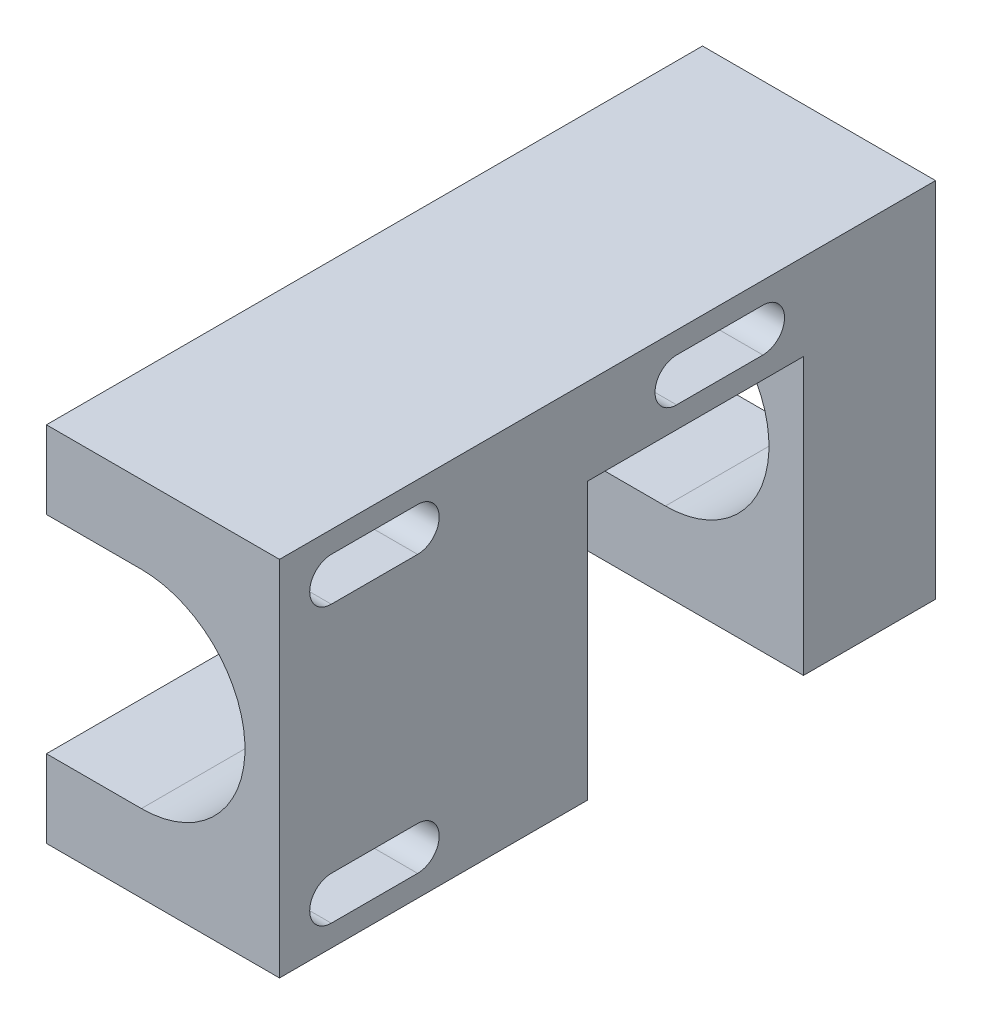
ISO-10303-21;
HEADER;
FILE_DESCRIPTION(('STEP AP214'),'2;1');
FILE_NAME('part.step','',(''),(''),'','','');
FILE_SCHEMA(('AUTOMOTIVE_DESIGN { 1 0 10303 214 1 1 1 1 }'));
ENDSEC;
DATA;
#1=APPLICATION_CONTEXT('core data for automotive mechanical design processes');
#2=APPLICATION_PROTOCOL_DEFINITION('international standard','automotive_design',2000,#1);
#3=PRODUCT_CONTEXT('',#1,'mechanical');
#4=PRODUCT('Part','Part','',(#3));
#5=PRODUCT_RELATED_PRODUCT_CATEGORY('part','',(#4));
#6=PRODUCT_DEFINITION_FORMATION('','',#4);
#7=PRODUCT_DEFINITION_CONTEXT('part definition',#1,'design');
#8=PRODUCT_DEFINITION('design','',#6,#7);
#9=PRODUCT_DEFINITION_SHAPE('','',#8);
#10=(LENGTH_UNIT() NAMED_UNIT(*) SI_UNIT(.MILLI.,.METRE.));
#11=(NAMED_UNIT(*) PLANE_ANGLE_UNIT() SI_UNIT($,.RADIAN.));
#12=(NAMED_UNIT(*) SI_UNIT($,.STERADIAN.) SOLID_ANGLE_UNIT());
#13=UNCERTAINTY_MEASURE_WITH_UNIT(LENGTH_MEASURE(1.E-05),#10,'distance_accuracy_value','');
#14=(GEOMETRIC_REPRESENTATION_CONTEXT(3) GLOBAL_UNCERTAINTY_ASSIGNED_CONTEXT((#13)) GLOBAL_UNIT_ASSIGNED_CONTEXT((#10,
#11,#12)) REPRESENTATION_CONTEXT('',''));
#15=CARTESIAN_POINT('',(0.,0.,0.));
#16=DIRECTION('',(0.,0.,1.));
#17=DIRECTION('',(1.,0.,0.));
#18=AXIS2_PLACEMENT_3D('',#15,#16,#17);
#19=CARTESIAN_POINT('',(0.,0.,-76.));
#20=DIRECTION('',(-1.,0.,0.));
#21=DIRECTION('',(0.,-1.,0.));
#22=AXIS2_PLACEMENT_3D('',#19,#20,#21);
#23=PLANE('',#22);
#24=DIRECTION('',(0.,-1.,0.));
#25=VECTOR('',#24,1.);
#26=CARTESIAN_POINT('',(0.,0.,-35.7));
#27=LINE('',#26,#25);
#28=CARTESIAN_POINT('',(0.,9.,-35.7));
#29=VERTEX_POINT('',#28);
#30=CARTESIAN_POINT('',(0.,0.,-35.7));
#31=VERTEX_POINT('',#30);
#32=EDGE_CURVE('E216',#29,#31,#27,.T.);
#33=ORIENTED_EDGE('',*,*,#32,.T.);
#34=DIRECTION('',(0.,0.,1.));
#35=VECTOR('',#34,1.);
#36=CARTESIAN_POINT('',(0.,0.,-76.));
#37=LINE('',#36,#35);
#38=CARTESIAN_POINT('',(0.,0.,0.));
#39=VERTEX_POINT('',#38);
#40=EDGE_CURVE('E231',#31,#39,#37,.T.);
#41=ORIENTED_EDGE('',*,*,#40,.T.);
#42=DIRECTION('',(0.,-1.,0.));
#43=VECTOR('',#42,1.);
#44=CARTESIAN_POINT('',(0.,0.,0.));
#45=LINE('',#44,#43);
#46=CARTESIAN_POINT('',(0.,9.,0.));
#47=VERTEX_POINT('',#46);
#48=EDGE_CURVE('E260',#47,#39,#45,.T.);
#49=ORIENTED_EDGE('',*,*,#48,.F.);
#50=DIRECTION('',(0.,0.,1.));
#51=VECTOR('',#50,1.);
#52=CARTESIAN_POINT('',(0.,9.,-76.));
#53=LINE('',#52,#51);
#54=EDGE_CURVE('E249',#29,#47,#53,.T.);
#55=ORIENTED_EDGE('',*,*,#54,.F.);
#56=EDGE_LOOP('',(#33,#41,#49,#55));
#57=FACE_BOUND('',#56,.T.);
#58=CARTESIAN_POINT('',(0.,5.,-16.));
#59=DIRECTION('',(-1.,0.,0.));
#60=DIRECTION('',(0.,-1.,0.));
#61=AXIS2_PLACEMENT_3D('',#58,#59,#60);
#62=CIRCLE('',#61,2.49999999999999);
#63=CARTESIAN_POINT('',(0.,7.49999999999999,-16.));
#64=VERTEX_POINT('',#63);
#65=CARTESIAN_POINT('',(0.,2.50000000000001,-16.));
#66=VERTEX_POINT('',#65);
#67=EDGE_CURVE('E353',#64,#66,#62,.T.);
#68=ORIENTED_EDGE('',*,*,#67,.F.);
#69=DIRECTION('',(0.,0.,-1.));
#70=VECTOR('',#69,1.);
#71=CARTESIAN_POINT('',(0.,7.49999999999999,-16.));
#72=LINE('',#71,#70);
#73=CARTESIAN_POINT('',(0.,7.49999999999999,-6.));
#74=VERTEX_POINT('',#73);
#75=EDGE_CURVE('E343',#74,#64,#72,.T.);
#76=ORIENTED_EDGE('',*,*,#75,.F.);
#77=CARTESIAN_POINT('',(0.,5.,-6.));
#78=DIRECTION('',(-1.,0.,0.));
#79=DIRECTION('',(0.,-1.,0.));
#80=AXIS2_PLACEMENT_3D('',#77,#78,#79);
#81=CIRCLE('',#80,2.49999999999999);
#82=CARTESIAN_POINT('',(0.,2.50000000000001,-6.));
#83=VERTEX_POINT('',#82);
#84=EDGE_CURVE('E358',#83,#74,#81,.T.);
#85=ORIENTED_EDGE('',*,*,#84,.F.);
#86=DIRECTION('',(0.,0.,1.));
#87=VECTOR('',#86,1.);
#88=CARTESIAN_POINT('',(0.,2.50000000000001,-16.));
#89=LINE('',#88,#87);
#90=EDGE_CURVE('E355',#66,#83,#89,.T.);
#91=ORIENTED_EDGE('',*,*,#90,.F.);
#92=EDGE_LOOP('',(#68,#76,#85,#91));
#93=FACE_BOUND('',#92,.T.);
#94=ADVANCED_FACE('F33',(#57,#93),#23,.T.);
#95=CARTESIAN_POINT('',(27.,0.,-76.));
#96=DIRECTION('',(0.,-1.,0.));
#97=DIRECTION('',(0.,0.,-1.));
#98=AXIS2_PLACEMENT_3D('',#95,#96,#97);
#99=PLANE('',#98);
#100=DIRECTION('',(1.,0.,0.));
#101=VECTOR('',#100,1.);
#102=CARTESIAN_POINT('',(0.,0.,-35.7));
#103=LINE('',#102,#101);
#104=CARTESIAN_POINT('',(27.,0.,-35.7));
#105=VERTEX_POINT('',#104);
#106=EDGE_CURVE('E419',#31,#105,#103,.T.);
#107=ORIENTED_EDGE('',*,*,#106,.T.);
#108=DIRECTION('',(0.,0.,1.));
#109=VECTOR('',#108,1.);
#110=CARTESIAN_POINT('',(27.,0.,-76.));
#111=LINE('',#110,#109);
#112=CARTESIAN_POINT('',(27.,0.,0.));
#113=VERTEX_POINT('',#112);
#114=EDGE_CURVE('E242',#105,#113,#111,.T.);
#115=ORIENTED_EDGE('',*,*,#114,.T.);
#116=DIRECTION('',(1.,0.,0.));
#117=VECTOR('',#116,1.);
#118=CARTESIAN_POINT('',(27.,0.,0.));
#119=LINE('',#118,#117);
#120=EDGE_CURVE('E300',#39,#113,#119,.T.);
#121=ORIENTED_EDGE('',*,*,#120,.F.);
#122=ORIENTED_EDGE('',*,*,#40,.F.);
#123=EDGE_LOOP('',(#107,#115,#121,#122));
#124=FACE_BOUND('',#123,.T.);
#125=ADVANCED_FACE('F451',(#124),#99,.T.);
#126=CARTESIAN_POINT('',(0.,9.,-76.));
#127=DIRECTION('',(0.,-1.,0.));
#128=DIRECTION('',(0.,0.,-1.));
#129=AXIS2_PLACEMENT_3D('',#126,#127,#128);
#130=PLANE('',#129);
#131=DIRECTION('',(0.,0.,1.));
#132=VECTOR('',#131,1.);
#133=CARTESIAN_POINT('',(11.,9.,-76.));
#134=LINE('',#133,#132);
#135=CARTESIAN_POINT('',(11.,9.,-35.7));
#136=VERTEX_POINT('',#135);
#137=CARTESIAN_POINT('',(11.,9.,0.));
#138=VERTEX_POINT('',#137);
#139=EDGE_CURVE('E251',#136,#138,#134,.T.);
#140=ORIENTED_EDGE('',*,*,#139,.F.);
#141=DIRECTION('',(-1.,0.,0.));
#142=VECTOR('',#141,1.);
#143=CARTESIAN_POINT('',(0.,9.,-35.7));
#144=LINE('',#143,#142);
#145=EDGE_CURVE('E41',#136,#29,#144,.T.);
#146=ORIENTED_EDGE('',*,*,#145,.T.);
#147=ORIENTED_EDGE('',*,*,#54,.T.);
#148=DIRECTION('',(1.,0.,0.));
#149=VECTOR('',#148,1.);
#150=CARTESIAN_POINT('',(0.,9.,0.));
#151=LINE('',#150,#149);
#152=EDGE_CURVE('E413',#47,#138,#151,.T.);
#153=ORIENTED_EDGE('',*,*,#152,.T.);
#154=EDGE_LOOP('',(#140,#146,#147,#153));
#155=FACE_BOUND('',#154,.T.);
#156=ADVANCED_FACE('F247',(#155),#130,.F.);
#157=DIRECTION('',(0.,1.,0.));
#158=VECTOR('',#157,1.);
#159=CARTESIAN_POINT('',(0.,32.,-60.7));
#160=LINE('',#159,#158);
#161=CARTESIAN_POINT('',(0.,0.,-60.7));
#162=VERTEX_POINT('',#161);
#163=CARTESIAN_POINT('',(0.,9.,-60.7));
#164=VERTEX_POINT('',#163);
#165=EDGE_CURVE('E205',#162,#164,#160,.T.);
#166=ORIENTED_EDGE('',*,*,#165,.T.);
#167=CARTESIAN_POINT('',(0.,9.,-76.));
#168=VERTEX_POINT('',#167);
#169=EDGE_CURVE('E261',#168,#164,#53,.T.);
#170=ORIENTED_EDGE('',*,*,#169,.F.);
#171=DIRECTION('',(0.,-1.,0.));
#172=VECTOR('',#171,1.);
#173=CARTESIAN_POINT('',(0.,0.,-76.));
#174=LINE('',#173,#172);
#175=CARTESIAN_POINT('',(0.,0.,-76.));
#176=VERTEX_POINT('',#175);
#177=EDGE_CURVE('E230',#168,#176,#174,.T.);
#178=ORIENTED_EDGE('',*,*,#177,.T.);
#179=EDGE_CURVE('E223',#176,#162,#37,.T.);
#180=ORIENTED_EDGE('',*,*,#179,.T.);
#181=EDGE_LOOP('',(#166,#170,#178,#180));
#182=FACE_BOUND('',#181,.T.);
#183=ADVANCED_FACE('F228',(#182),#23,.T.);
#184=DIRECTION('',(1.,0.,0.));
#185=VECTOR('',#184,1.);
#186=CARTESIAN_POINT('',(0.,0.,-60.7));
#187=LINE('',#186,#185);
#188=CARTESIAN_POINT('',(27.,0.,-60.7));
#189=VERTEX_POINT('',#188);
#190=EDGE_CURVE('E209',#162,#189,#187,.T.);
#191=ORIENTED_EDGE('',*,*,#190,.F.);
#192=ORIENTED_EDGE('',*,*,#179,.F.);
#193=DIRECTION('',(1.,0.,0.));
#194=VECTOR('',#193,1.);
#195=CARTESIAN_POINT('',(27.,0.,-76.));
#196=LINE('',#195,#194);
#197=CARTESIAN_POINT('',(27.,0.,-76.));
#198=VERTEX_POINT('',#197);
#199=EDGE_CURVE('E370',#176,#198,#196,.T.);
#200=ORIENTED_EDGE('',*,*,#199,.T.);
#201=EDGE_CURVE('E225',#198,#189,#111,.T.);
#202=ORIENTED_EDGE('',*,*,#201,.T.);
#203=EDGE_LOOP('',(#191,#192,#200,#202));
#204=FACE_BOUND('',#203,.T.);
#205=ADVANCED_FACE('F35',(#204),#99,.T.);
#206=DIRECTION('',(0.,0.,1.));
#207=VECTOR('',#206,1.);
#208=CARTESIAN_POINT('',(0.,33.,-76.));
#209=LINE('',#208,#207);
#210=CARTESIAN_POINT('',(0.,33.,-76.));
#211=VERTEX_POINT('',#210);
#212=CARTESIAN_POINT('',(0.,33.,0.));
#213=VERTEX_POINT('',#212);
#214=EDGE_CURVE('E262',#211,#213,#209,.T.);
#215=ORIENTED_EDGE('',*,*,#214,.T.);
#216=CARTESIAN_POINT('',(0.,42.,0.));
#217=VERTEX_POINT('',#216);
#218=EDGE_CURVE('E237',#217,#213,#45,.T.);
#219=ORIENTED_EDGE('',*,*,#218,.F.);
#220=DIRECTION('',(0.,0.,1.));
#221=VECTOR('',#220,1.);
#222=CARTESIAN_POINT('',(0.,42.,-76.));
#223=LINE('',#222,#221);
#224=CARTESIAN_POINT('',(0.,42.,-76.));
#225=VERTEX_POINT('',#224);
#226=EDGE_CURVE('E234',#225,#217,#223,.T.);
#227=ORIENTED_EDGE('',*,*,#226,.F.);
#228=EDGE_CURVE('E378',#225,#211,#174,.T.);
#229=ORIENTED_EDGE('',*,*,#228,.T.);
#230=EDGE_LOOP('',(#215,#219,#227,#229));
#231=FACE_BOUND('',#230,.T.);
#232=CARTESIAN_POINT('',(0.,37.,-56.));
#233=DIRECTION('',(-1.,0.,0.));
#234=DIRECTION('',(0.,-1.,0.));
#235=AXIS2_PLACEMENT_3D('',#232,#233,#234);
#236=CIRCLE('',#235,2.5);
#237=CARTESIAN_POINT('',(0.,39.5,-56.));
#238=VERTEX_POINT('',#237);
#239=CARTESIAN_POINT('',(0.,34.5,-56.));
#240=VERTEX_POINT('',#239);
#241=EDGE_CURVE('E287',#238,#240,#236,.T.);
#242=ORIENTED_EDGE('',*,*,#241,.F.);
#243=DIRECTION('',(0.,0.,-1.));
#244=VECTOR('',#243,1.);
#245=CARTESIAN_POINT('',(0.,39.5,-56.));
#246=LINE('',#245,#244);
#247=CARTESIAN_POINT('',(0.,39.5,-46.));
#248=VERTEX_POINT('',#247);
#249=EDGE_CURVE('E277',#248,#238,#246,.T.);
#250=ORIENTED_EDGE('',*,*,#249,.F.);
#251=CARTESIAN_POINT('',(0.,37.,-46.));
#252=DIRECTION('',(-1.,0.,0.));
#253=DIRECTION('',(0.,-1.,0.));
#254=AXIS2_PLACEMENT_3D('',#251,#252,#253);
#255=CIRCLE('',#254,2.5);
#256=CARTESIAN_POINT('',(0.,34.5,-46.));
#257=VERTEX_POINT('',#256);
#258=EDGE_CURVE('E293',#257,#248,#255,.T.);
#259=ORIENTED_EDGE('',*,*,#258,.F.);
#260=DIRECTION('',(0.,0.,1.));
#261=VECTOR('',#260,1.);
#262=CARTESIAN_POINT('',(0.,34.5,-56.));
#263=LINE('',#262,#261);
#264=EDGE_CURVE('E289',#240,#257,#263,.T.);
#265=ORIENTED_EDGE('',*,*,#264,.F.);
#266=EDGE_LOOP('',(#242,#250,#259,#265));
#267=FACE_BOUND('',#266,.T.);
#268=CARTESIAN_POINT('',(0.,37.,-16.));
#269=DIRECTION('',(-1.,0.,0.));
#270=DIRECTION('',(0.,-1.,0.));
#271=AXIS2_PLACEMENT_3D('',#268,#269,#270);
#272=CIRCLE('',#271,2.5);
#273=CARTESIAN_POINT('',(0.,39.5,-16.));
#274=VERTEX_POINT('',#273);
#275=CARTESIAN_POINT('',(0.,34.5,-16.));
#276=VERTEX_POINT('',#275);
#277=EDGE_CURVE('E321',#274,#276,#272,.T.);
#278=ORIENTED_EDGE('',*,*,#277,.F.);
#279=DIRECTION('',(0.,0.,-1.));
#280=VECTOR('',#279,1.);
#281=CARTESIAN_POINT('',(0.,39.5,-16.));
#282=LINE('',#281,#280);
#283=CARTESIAN_POINT('',(0.,39.5,-6.00000000000001));
#284=VERTEX_POINT('',#283);
#285=EDGE_CURVE('E311',#284,#274,#282,.T.);
#286=ORIENTED_EDGE('',*,*,#285,.F.);
#287=CARTESIAN_POINT('',(0.,37.,-6.00000000000001));
#288=DIRECTION('',(-1.,0.,0.));
#289=DIRECTION('',(0.,-1.,0.));
#290=AXIS2_PLACEMENT_3D('',#287,#288,#289);
#291=CIRCLE('',#290,2.5);
#292=CARTESIAN_POINT('',(0.,34.5,-6.00000000000001));
#293=VERTEX_POINT('',#292);
#294=EDGE_CURVE('E327',#293,#284,#291,.T.);
#295=ORIENTED_EDGE('',*,*,#294,.F.);
#296=DIRECTION('',(0.,0.,1.));
#297=VECTOR('',#296,1.);
#298=CARTESIAN_POINT('',(0.,34.5,-16.));
#299=LINE('',#298,#297);
#300=EDGE_CURVE('E323',#276,#293,#299,.T.);
#301=ORIENTED_EDGE('',*,*,#300,.F.);
#302=EDGE_LOOP('',(#278,#286,#295,#301));
#303=FACE_BOUND('',#302,.T.);
#304=ADVANCED_FACE('F396',(#231,#267,#303),#23,.T.);
#305=CARTESIAN_POINT('',(0.,42.,-76.));
#306=DIRECTION('',(0.,1.,0.));
#307=DIRECTION('',(0.,0.,1.));
#308=AXIS2_PLACEMENT_3D('',#305,#306,#307);
#309=PLANE('',#308);
#310=DIRECTION('',(-1.,0.,0.));
#311=VECTOR('',#310,1.);
#312=CARTESIAN_POINT('',(0.,42.,0.));
#313=LINE('',#312,#311);
#314=CARTESIAN_POINT('',(27.,42.,0.));
#315=VERTEX_POINT('',#314);
#316=EDGE_CURVE('E385',#315,#217,#313,.T.);
#317=ORIENTED_EDGE('',*,*,#316,.F.);
#318=DIRECTION('',(0.,0.,1.));
#319=VECTOR('',#318,1.);
#320=CARTESIAN_POINT('',(27.,42.,-76.));
#321=LINE('',#320,#319);
#322=CARTESIAN_POINT('',(27.,42.,-76.));
#323=VERTEX_POINT('',#322);
#324=EDGE_CURVE('E240',#323,#315,#321,.T.);
#325=ORIENTED_EDGE('',*,*,#324,.F.);
#326=DIRECTION('',(-1.,0.,0.));
#327=VECTOR('',#326,1.);
#328=CARTESIAN_POINT('',(0.,42.,-76.));
#329=LINE('',#328,#327);
#330=EDGE_CURVE('E375',#323,#225,#329,.T.);
#331=ORIENTED_EDGE('',*,*,#330,.T.);
#332=ORIENTED_EDGE('',*,*,#226,.T.);
#333=EDGE_LOOP('',(#317,#325,#331,#332));
#334=FACE_BOUND('',#333,.T.);
#335=ADVANCED_FACE('F449',(#334),#309,.T.);
#336=CARTESIAN_POINT('',(27.,42.,-76.));
#337=DIRECTION('',(1.,0.,0.));
#338=DIRECTION('',(0.,1.,0.));
#339=AXIS2_PLACEMENT_3D('',#336,#337,#338);
#340=PLANE('',#339);
#341=DIRECTION('',(0.,-1.,0.));
#342=VECTOR('',#341,1.);
#343=CARTESIAN_POINT('',(27.,0.,-35.7));
#344=LINE('',#343,#342);
#345=CARTESIAN_POINT('',(27.,32.,-35.7));
#346=VERTEX_POINT('',#345);
#347=EDGE_CURVE('E217',#346,#105,#344,.T.);
#348=ORIENTED_EDGE('',*,*,#347,.F.);
#349=DIRECTION('',(0.,0.,1.));
#350=VECTOR('',#349,1.);
#351=CARTESIAN_POINT('',(27.,32.,-35.7));
#352=LINE('',#351,#350);
#353=CARTESIAN_POINT('',(27.,32.,-60.7));
#354=VERTEX_POINT('',#353);
#355=EDGE_CURVE('E428',#354,#346,#352,.T.);
#356=ORIENTED_EDGE('',*,*,#355,.F.);
#357=DIRECTION('',(0.,1.,0.));
#358=VECTOR('',#357,1.);
#359=CARTESIAN_POINT('',(27.,32.,-60.7));
#360=LINE('',#359,#358);
#361=EDGE_CURVE('E431',#189,#354,#360,.T.);
#362=ORIENTED_EDGE('',*,*,#361,.F.);
#363=ORIENTED_EDGE('',*,*,#201,.F.);
#364=DIRECTION('',(0.,1.,0.));
#365=VECTOR('',#364,1.);
#366=CARTESIAN_POINT('',(27.,42.,-76.));
#367=LINE('',#366,#365);
#368=EDGE_CURVE('E372',#198,#323,#367,.T.);
#369=ORIENTED_EDGE('',*,*,#368,.T.);
#370=ORIENTED_EDGE('',*,*,#324,.T.);
#371=DIRECTION('',(0.,1.,0.));
#372=VECTOR('',#371,1.);
#373=CARTESIAN_POINT('',(27.,42.,0.));
#374=LINE('',#373,#372);
#375=EDGE_CURVE('E383',#113,#315,#374,.T.);
#376=ORIENTED_EDGE('',*,*,#375,.F.);
#377=ORIENTED_EDGE('',*,*,#114,.F.);
#378=EDGE_LOOP('',(#348,#356,#362,#363,#369,#370,#376,#377));
#379=FACE_BOUND('',#378,.T.);
#380=CARTESIAN_POINT('',(27.,37.,-56.));
#381=DIRECTION('',(-1.,0.,0.));
#382=DIRECTION('',(0.,-1.,0.));
#383=AXIS2_PLACEMENT_3D('',#380,#381,#382);
#384=CIRCLE('',#383,2.5);
#385=CARTESIAN_POINT('',(27.,39.5,-56.));
#386=VERTEX_POINT('',#385);
#387=CARTESIAN_POINT('',(27.,34.5,-56.));
#388=VERTEX_POINT('',#387);
#389=EDGE_CURVE('E273',#386,#388,#384,.T.);
#390=ORIENTED_EDGE('',*,*,#389,.T.);
#391=DIRECTION('',(0.,0.,1.));
#392=VECTOR('',#391,1.);
#393=CARTESIAN_POINT('',(27.,34.5,-56.));
#394=LINE('',#393,#392);
#395=CARTESIAN_POINT('',(27.,34.5,-46.));
#396=VERTEX_POINT('',#395);
#397=EDGE_CURVE('E276',#388,#396,#394,.T.);
#398=ORIENTED_EDGE('',*,*,#397,.T.);
#399=CARTESIAN_POINT('',(27.,37.,-46.));
#400=DIRECTION('',(-1.,0.,0.));
#401=DIRECTION('',(0.,-1.,0.));
#402=AXIS2_PLACEMENT_3D('',#399,#400,#401);
#403=CIRCLE('',#402,2.5);
#404=CARTESIAN_POINT('',(27.,39.5,-46.));
#405=VERTEX_POINT('',#404);
#406=EDGE_CURVE('E280',#396,#405,#403,.T.);
#407=ORIENTED_EDGE('',*,*,#406,.T.);
#408=DIRECTION('',(0.,0.,-1.));
#409=VECTOR('',#408,1.);
#410=CARTESIAN_POINT('',(27.,39.5,-56.));
#411=LINE('',#410,#409);
#412=EDGE_CURVE('E283',#405,#386,#411,.T.);
#413=ORIENTED_EDGE('',*,*,#412,.T.);
#414=EDGE_LOOP('',(#390,#398,#407,#413));
#415=FACE_BOUND('',#414,.T.);
#416=CARTESIAN_POINT('',(27.,37.,-16.));
#417=DIRECTION('',(-1.,0.,0.));
#418=DIRECTION('',(0.,-1.,0.));
#419=AXIS2_PLACEMENT_3D('',#416,#417,#418);
#420=CIRCLE('',#419,2.5);
#421=CARTESIAN_POINT('',(27.,39.5,-16.));
#422=VERTEX_POINT('',#421);
#423=CARTESIAN_POINT('',(27.,34.5,-16.));
#424=VERTEX_POINT('',#423);
#425=EDGE_CURVE('E307',#422,#424,#420,.T.);
#426=ORIENTED_EDGE('',*,*,#425,.T.);
#427=DIRECTION('',(0.,0.,1.));
#428=VECTOR('',#427,1.);
#429=CARTESIAN_POINT('',(27.,34.5,-16.));
#430=LINE('',#429,#428);
#431=CARTESIAN_POINT('',(27.,34.5,-6.00000000000001));
#432=VERTEX_POINT('',#431);
#433=EDGE_CURVE('E310',#424,#432,#430,.T.);
#434=ORIENTED_EDGE('',*,*,#433,.T.);
#435=CARTESIAN_POINT('',(27.,37.,-6.00000000000001));
#436=DIRECTION('',(-1.,0.,0.));
#437=DIRECTION('',(0.,-1.,0.));
#438=AXIS2_PLACEMENT_3D('',#435,#436,#437);
#439=CIRCLE('',#438,2.5);
#440=CARTESIAN_POINT('',(27.,39.5,-6.00000000000001));
#441=VERTEX_POINT('',#440);
#442=EDGE_CURVE('E314',#432,#441,#439,.T.);
#443=ORIENTED_EDGE('',*,*,#442,.T.);
#444=DIRECTION('',(0.,0.,-1.));
#445=VECTOR('',#444,1.);
#446=CARTESIAN_POINT('',(27.,39.5,-16.));
#447=LINE('',#446,#445);
#448=EDGE_CURVE('E317',#441,#422,#447,.T.);
#449=ORIENTED_EDGE('',*,*,#448,.T.);
#450=EDGE_LOOP('',(#426,#434,#443,#449));
#451=FACE_BOUND('',#450,.T.);
#452=CARTESIAN_POINT('',(27.,5.,-16.));
#453=DIRECTION('',(-1.,0.,0.));
#454=DIRECTION('',(0.,-1.,0.));
#455=AXIS2_PLACEMENT_3D('',#452,#453,#454);
#456=CIRCLE('',#455,2.49999999999999);
#457=CARTESIAN_POINT('',(27.,7.49999999999999,-16.));
#458=VERTEX_POINT('',#457);
#459=CARTESIAN_POINT('',(27.,2.50000000000002,-16.));
#460=VERTEX_POINT('',#459);
#461=EDGE_CURVE('E339',#458,#460,#456,.T.);
#462=ORIENTED_EDGE('',*,*,#461,.T.);
#463=DIRECTION('',(0.,0.,1.));
#464=VECTOR('',#463,1.);
#465=CARTESIAN_POINT('',(27.,2.50000000000002,-16.));
#466=LINE('',#465,#464);
#467=CARTESIAN_POINT('',(27.,2.50000000000002,-6.00000000000001));
#468=VERTEX_POINT('',#467);
#469=EDGE_CURVE('E342',#460,#468,#466,.T.);
#470=ORIENTED_EDGE('',*,*,#469,.T.);
#471=CARTESIAN_POINT('',(27.,5.,-6.));
#472=DIRECTION('',(-1.,0.,0.));
#473=DIRECTION('',(0.,-1.,0.));
#474=AXIS2_PLACEMENT_3D('',#471,#472,#473);
#475=CIRCLE('',#474,2.49999999999999);
#476=CARTESIAN_POINT('',(27.,7.49999999999999,-6.));
#477=VERTEX_POINT('',#476);
#478=EDGE_CURVE('E346',#468,#477,#475,.T.);
#479=ORIENTED_EDGE('',*,*,#478,.T.);
#480=DIRECTION('',(0.,0.,-1.));
#481=VECTOR('',#480,1.);
#482=CARTESIAN_POINT('',(27.,7.49999999999999,-16.));
#483=LINE('',#482,#481);
#484=EDGE_CURVE('E349',#477,#458,#483,.T.);
#485=ORIENTED_EDGE('',*,*,#484,.T.);
#486=EDGE_LOOP('',(#462,#470,#479,#485));
#487=FACE_BOUND('',#486,.T.);
#488=ADVANCED_FACE('F436',(#379,#415,#451,#487),#340,.T.);
#489=CARTESIAN_POINT('',(0.,0.,-76.));
#490=DIRECTION('',(0.,0.,-1.));
#491=DIRECTION('',(-1.,0.,0.));
#492=AXIS2_PLACEMENT_3D('',#489,#490,#491);
#493=PLANE('',#492);
#494=DIRECTION('',(1.,0.,0.));
#495=VECTOR('',#494,1.);
#496=CARTESIAN_POINT('',(0.,9.,-76.));
#497=LINE('',#496,#495);
#498=CARTESIAN_POINT('',(11.,9.,-76.));
#499=VERTEX_POINT('',#498);
#500=EDGE_CURVE('E272',#168,#499,#497,.T.);
#501=ORIENTED_EDGE('',*,*,#500,.T.);
#502=CARTESIAN_POINT('',(11.,21.,-76.));
#503=DIRECTION('',(0.,0.,1.));
#504=DIRECTION('',(-1.,0.,0.));
#505=AXIS2_PLACEMENT_3D('',#502,#503,#504);
#506=CIRCLE('',#505,12.);
#507=CARTESIAN_POINT('',(11.,33.,-76.));
#508=VERTEX_POINT('',#507);
#509=EDGE_CURVE('E410',#499,#508,#506,.T.);
#510=ORIENTED_EDGE('',*,*,#509,.T.);
#511=DIRECTION('',(-1.,0.,0.));
#512=VECTOR('',#511,1.);
#513=CARTESIAN_POINT('',(11.,33.,-76.));
#514=LINE('',#513,#512);
#515=EDGE_CURVE('E403',#508,#211,#514,.T.);
#516=ORIENTED_EDGE('',*,*,#515,.T.);
#517=ORIENTED_EDGE('',*,*,#228,.F.);
#518=ORIENTED_EDGE('',*,*,#330,.F.);
#519=ORIENTED_EDGE('',*,*,#368,.F.);
#520=ORIENTED_EDGE('',*,*,#199,.F.);
#521=ORIENTED_EDGE('',*,*,#177,.F.);
#522=EDGE_LOOP('',(#501,#510,#516,#517,#518,#519,#520,#521));
#523=FACE_BOUND('',#522,.T.);
#524=ADVANCED_FACE('F407',(#523),#493,.T.);
#525=CARTESIAN_POINT('',(0.,0.,0.));
#526=DIRECTION('',(0.,0.,-1.));
#527=DIRECTION('',(-1.,0.,0.));
#528=AXIS2_PLACEMENT_3D('',#525,#526,#527);
#529=PLANE('',#528);
#530=CARTESIAN_POINT('',(11.,21.,0.));
#531=DIRECTION('',(0.,0.,1.));
#532=DIRECTION('',(-1.,0.,0.));
#533=AXIS2_PLACEMENT_3D('',#530,#531,#532);
#534=CIRCLE('',#533,12.);
#535=CARTESIAN_POINT('',(11.,33.,0.));
#536=VERTEX_POINT('',#535);
#537=EDGE_CURVE('E56',#138,#536,#534,.T.);
#538=ORIENTED_EDGE('',*,*,#537,.F.);
#539=ORIENTED_EDGE('',*,*,#152,.F.);
#540=ORIENTED_EDGE('',*,*,#48,.T.);
#541=ORIENTED_EDGE('',*,*,#120,.T.);
#542=ORIENTED_EDGE('',*,*,#375,.T.);
#543=ORIENTED_EDGE('',*,*,#316,.T.);
#544=ORIENTED_EDGE('',*,*,#218,.T.);
#545=DIRECTION('',(-1.,0.,0.));
#546=VECTOR('',#545,1.);
#547=CARTESIAN_POINT('',(11.,33.,0.));
#548=LINE('',#547,#546);
#549=EDGE_CURVE('E394',#536,#213,#548,.T.);
#550=ORIENTED_EDGE('',*,*,#549,.F.);
#551=EDGE_LOOP('',(#538,#539,#540,#541,#542,#543,#544,#550));
#552=FACE_BOUND('',#551,.T.);
#553=ADVANCED_FACE('F393',(#552),#529,.F.);
#554=CARTESIAN_POINT('',(27.,5.,-16.));
#555=DIRECTION('',(-1.,0.,0.));
#556=DIRECTION('',(0.,-1.,0.));
#557=AXIS2_PLACEMENT_3D('',#554,#555,#556);
#558=CYLINDRICAL_SURFACE('',#557,2.49999999999999);
#559=ORIENTED_EDGE('',*,*,#67,.T.);
#560=DIRECTION('',(-1.,0.,0.));
#561=VECTOR('',#560,1.);
#562=CARTESIAN_POINT('',(27.,2.50000000000002,-16.));
#563=LINE('',#562,#561);
#564=EDGE_CURVE('E352',#460,#66,#563,.T.);
#565=ORIENTED_EDGE('',*,*,#564,.F.);
#566=ORIENTED_EDGE('',*,*,#461,.F.);
#567=DIRECTION('',(-1.,0.,0.));
#568=VECTOR('',#567,1.);
#569=CARTESIAN_POINT('',(27.,7.49999999999999,-16.));
#570=LINE('',#569,#568);
#571=EDGE_CURVE('E324',#458,#64,#570,.T.);
#572=ORIENTED_EDGE('',*,*,#571,.T.);
#573=EDGE_LOOP('',(#559,#565,#566,#572));
#574=FACE_BOUND('',#573,.T.);
#575=ADVANCED_FACE('F515',(#574),#558,.F.);
#576=CARTESIAN_POINT('',(27.,7.49999999999999,-16.));
#577=DIRECTION('',(0.,1.,0.));
#578=DIRECTION('',(-1.,0.,0.));
#579=AXIS2_PLACEMENT_3D('',#576,#577,#578);
#580=PLANE('',#579);
#581=ORIENTED_EDGE('',*,*,#75,.T.);
#582=ORIENTED_EDGE('',*,*,#571,.F.);
#583=ORIENTED_EDGE('',*,*,#484,.F.);
#584=DIRECTION('',(-1.,0.,0.));
#585=VECTOR('',#584,1.);
#586=CARTESIAN_POINT('',(27.,7.49999999999999,-6.));
#587=LINE('',#586,#585);
#588=EDGE_CURVE('E364',#477,#74,#587,.T.);
#589=ORIENTED_EDGE('',*,*,#588,.T.);
#590=EDGE_LOOP('',(#581,#582,#583,#589));
#591=FACE_BOUND('',#590,.T.);
#592=ADVANCED_FACE('F632',(#591),#580,.F.);
#593=CARTESIAN_POINT('',(27.,5.,-6.));
#594=DIRECTION('',(-1.,0.,0.));
#595=DIRECTION('',(0.,-1.,0.));
#596=AXIS2_PLACEMENT_3D('',#593,#594,#595);
#597=CYLINDRICAL_SURFACE('',#596,2.49999999999999);
#598=ORIENTED_EDGE('',*,*,#84,.T.);
#599=ORIENTED_EDGE('',*,*,#588,.F.);
#600=ORIENTED_EDGE('',*,*,#478,.F.);
#601=DIRECTION('',(-1.,0.,0.));
#602=VECTOR('',#601,1.);
#603=CARTESIAN_POINT('',(27.,2.50000000000002,-6.));
#604=LINE('',#603,#602);
#605=EDGE_CURVE('E366',#468,#83,#604,.T.);
#606=ORIENTED_EDGE('',*,*,#605,.T.);
#607=EDGE_LOOP('',(#598,#599,#600,#606));
#608=FACE_BOUND('',#607,.T.);
#609=ADVANCED_FACE('F622',(#608),#597,.F.);
#610=CARTESIAN_POINT('',(27.,2.50000000000002,-16.));
#611=DIRECTION('',(0.,-1.,0.));
#612=DIRECTION('',(1.,0.,0.));
#613=AXIS2_PLACEMENT_3D('',#610,#611,#612);
#614=PLANE('',#613);
#615=ORIENTED_EDGE('',*,*,#90,.T.);
#616=ORIENTED_EDGE('',*,*,#605,.F.);
#617=ORIENTED_EDGE('',*,*,#469,.F.);
#618=ORIENTED_EDGE('',*,*,#564,.T.);
#619=EDGE_LOOP('',(#615,#616,#617,#618));
#620=FACE_BOUND('',#619,.T.);
#621=ADVANCED_FACE('F612',(#620),#614,.F.);
#622=CARTESIAN_POINT('',(27.,37.,-16.));
#623=DIRECTION('',(-1.,0.,0.));
#624=DIRECTION('',(0.,-1.,0.));
#625=AXIS2_PLACEMENT_3D('',#622,#623,#624);
#626=CYLINDRICAL_SURFACE('',#625,2.5);
#627=ORIENTED_EDGE('',*,*,#277,.T.);
#628=DIRECTION('',(-1.,0.,0.));
#629=VECTOR('',#628,1.);
#630=CARTESIAN_POINT('',(27.,34.5,-16.));
#631=LINE('',#630,#629);
#632=EDGE_CURVE('E320',#424,#276,#631,.T.);
#633=ORIENTED_EDGE('',*,*,#632,.F.);
#634=ORIENTED_EDGE('',*,*,#425,.F.);
#635=DIRECTION('',(-1.,0.,0.));
#636=VECTOR('',#635,1.);
#637=CARTESIAN_POINT('',(27.,39.5,-16.));
#638=LINE('',#637,#636);
#639=EDGE_CURVE('E290',#422,#274,#638,.T.);
#640=ORIENTED_EDGE('',*,*,#639,.T.);
#641=EDGE_LOOP('',(#627,#633,#634,#640));
#642=FACE_BOUND('',#641,.T.);
#643=ADVANCED_FACE('F602',(#642),#626,.F.);
#644=CARTESIAN_POINT('',(27.,39.5,-16.));
#645=DIRECTION('',(0.,1.,0.));
#646=DIRECTION('',(-1.,0.,0.));
#647=AXIS2_PLACEMENT_3D('',#644,#645,#646);
#648=PLANE('',#647);
#649=ORIENTED_EDGE('',*,*,#285,.T.);
#650=ORIENTED_EDGE('',*,*,#639,.F.);
#651=ORIENTED_EDGE('',*,*,#448,.F.);
#652=DIRECTION('',(-1.,0.,0.));
#653=VECTOR('',#652,1.);
#654=CARTESIAN_POINT('',(27.,39.5,-6.00000000000001));
#655=LINE('',#654,#653);
#656=EDGE_CURVE('E333',#441,#284,#655,.T.);
#657=ORIENTED_EDGE('',*,*,#656,.T.);
#658=EDGE_LOOP('',(#649,#650,#651,#657));
#659=FACE_BOUND('',#658,.T.);
#660=ADVANCED_FACE('F592',(#659),#648,.F.);
#661=CARTESIAN_POINT('',(27.,37.,-6.00000000000001));
#662=DIRECTION('',(-1.,0.,0.));
#663=DIRECTION('',(0.,-1.,0.));
#664=AXIS2_PLACEMENT_3D('',#661,#662,#663);
#665=CYLINDRICAL_SURFACE('',#664,2.5);
#666=ORIENTED_EDGE('',*,*,#294,.T.);
#667=ORIENTED_EDGE('',*,*,#656,.F.);
#668=ORIENTED_EDGE('',*,*,#442,.F.);
#669=DIRECTION('',(-1.,0.,0.));
#670=VECTOR('',#669,1.);
#671=CARTESIAN_POINT('',(27.,34.5,-6.00000000000001));
#672=LINE('',#671,#670);
#673=EDGE_CURVE('E335',#432,#293,#672,.T.);
#674=ORIENTED_EDGE('',*,*,#673,.T.);
#675=EDGE_LOOP('',(#666,#667,#668,#674));
#676=FACE_BOUND('',#675,.T.);
#677=ADVANCED_FACE('F582',(#676),#665,.F.);
#678=CARTESIAN_POINT('',(27.,34.5,-16.));
#679=DIRECTION('',(0.,-1.,0.));
#680=DIRECTION('',(1.,0.,0.));
#681=AXIS2_PLACEMENT_3D('',#678,#679,#680);
#682=PLANE('',#681);
#683=ORIENTED_EDGE('',*,*,#300,.T.);
#684=ORIENTED_EDGE('',*,*,#673,.F.);
#685=ORIENTED_EDGE('',*,*,#433,.F.);
#686=ORIENTED_EDGE('',*,*,#632,.T.);
#687=EDGE_LOOP('',(#683,#684,#685,#686));
#688=FACE_BOUND('',#687,.T.);
#689=ADVANCED_FACE('F572',(#688),#682,.F.);
#690=CARTESIAN_POINT('',(27.,37.,-56.));
#691=DIRECTION('',(-1.,0.,0.));
#692=DIRECTION('',(0.,-1.,0.));
#693=AXIS2_PLACEMENT_3D('',#690,#691,#692);
#694=CYLINDRICAL_SURFACE('',#693,2.5);
#695=ORIENTED_EDGE('',*,*,#241,.T.);
#696=DIRECTION('',(-1.,0.,0.));
#697=VECTOR('',#696,1.);
#698=CARTESIAN_POINT('',(27.,34.5,-56.));
#699=LINE('',#698,#697);
#700=EDGE_CURVE('E286',#388,#240,#699,.T.);
#701=ORIENTED_EDGE('',*,*,#700,.F.);
#702=ORIENTED_EDGE('',*,*,#389,.F.);
#703=DIRECTION('',(-1.,0.,0.));
#704=VECTOR('',#703,1.);
#705=CARTESIAN_POINT('',(27.,39.5,-56.));
#706=LINE('',#705,#704);
#707=EDGE_CURVE('E298',#386,#238,#706,.T.);
#708=ORIENTED_EDGE('',*,*,#707,.T.);
#709=EDGE_LOOP('',(#695,#701,#702,#708));
#710=FACE_BOUND('',#709,.T.);
#711=ADVANCED_FACE('F562',(#710),#694,.F.);
#712=CARTESIAN_POINT('',(27.,39.5,-56.));
#713=DIRECTION('',(0.,1.,0.));
#714=DIRECTION('',(0.,0.,1.));
#715=AXIS2_PLACEMENT_3D('',#712,#713,#714);
#716=PLANE('',#715);
#717=ORIENTED_EDGE('',*,*,#249,.T.);
#718=ORIENTED_EDGE('',*,*,#707,.F.);
#719=ORIENTED_EDGE('',*,*,#412,.F.);
#720=DIRECTION('',(-1.,0.,0.));
#721=VECTOR('',#720,1.);
#722=CARTESIAN_POINT('',(27.,39.5,-46.));
#723=LINE('',#722,#721);
#724=EDGE_CURVE('E301',#405,#248,#723,.T.);
#725=ORIENTED_EDGE('',*,*,#724,.T.);
#726=EDGE_LOOP('',(#717,#718,#719,#725));
#727=FACE_BOUND('',#726,.T.);
#728=ADVANCED_FACE('F552',(#727),#716,.F.);
#729=CARTESIAN_POINT('',(27.,37.,-46.));
#730=DIRECTION('',(-1.,0.,0.));
#731=DIRECTION('',(0.,-1.,0.));
#732=AXIS2_PLACEMENT_3D('',#729,#730,#731);
#733=CYLINDRICAL_SURFACE('',#732,2.5);
#734=ORIENTED_EDGE('',*,*,#258,.T.);
#735=ORIENTED_EDGE('',*,*,#724,.F.);
#736=ORIENTED_EDGE('',*,*,#406,.F.);
#737=DIRECTION('',(-1.,0.,0.));
#738=VECTOR('',#737,1.);
#739=CARTESIAN_POINT('',(27.,34.5,-46.));
#740=LINE('',#739,#738);
#741=EDGE_CURVE('E303',#396,#257,#740,.T.);
#742=ORIENTED_EDGE('',*,*,#741,.T.);
#743=EDGE_LOOP('',(#734,#735,#736,#742));
#744=FACE_BOUND('',#743,.T.);
#745=ADVANCED_FACE('F541',(#744),#733,.F.);
#746=CARTESIAN_POINT('',(27.,34.5,-56.));
#747=DIRECTION('',(0.,-1.,0.));
#748=DIRECTION('',(0.,0.,-1.));
#749=AXIS2_PLACEMENT_3D('',#746,#747,#748);
#750=PLANE('',#749);
#751=ORIENTED_EDGE('',*,*,#264,.T.);
#752=ORIENTED_EDGE('',*,*,#741,.F.);
#753=ORIENTED_EDGE('',*,*,#397,.F.);
#754=ORIENTED_EDGE('',*,*,#700,.T.);
#755=EDGE_LOOP('',(#751,#752,#753,#754));
#756=FACE_BOUND('',#755,.T.);
#757=ADVANCED_FACE('F536',(#756),#750,.F.);
#758=CARTESIAN_POINT('',(11.,21.,-76.));
#759=DIRECTION('',(0.,0.,1.));
#760=DIRECTION('',(1.,0.,0.));
#761=AXIS2_PLACEMENT_3D('',#758,#759,#760);
#762=CYLINDRICAL_SURFACE('',#761,12.);
#763=DIRECTION('',(0.,0.,1.));
#764=VECTOR('',#763,1.);
#765=CARTESIAN_POINT('',(15.7958315233127,32.,-76.));
#766=LINE('',#765,#764);
#767=CARTESIAN_POINT('',(15.7958315233127,32.,-60.7));
#768=VERTEX_POINT('',#767);
#769=CARTESIAN_POINT('',(15.7958315233127,32.,-35.7));
#770=VERTEX_POINT('',#769);
#771=EDGE_CURVE('E11',#768,#770,#766,.T.);
#772=ORIENTED_EDGE('',*,*,#771,.T.);
#773=CARTESIAN_POINT('',(11.,21.,-35.7));
#774=DIRECTION('',(0.,0.,1.));
#775=DIRECTION('',(1.,0.,0.));
#776=AXIS2_PLACEMENT_3D('',#773,#774,#775);
#777=CIRCLE('',#776,12.);
#778=EDGE_CURVE('E418',#770,#136,#777,.F.);
#779=ORIENTED_EDGE('',*,*,#778,.T.);
#780=ORIENTED_EDGE('',*,*,#139,.T.);
#781=ORIENTED_EDGE('',*,*,#537,.T.);
#782=DIRECTION('',(0.,0.,1.));
#783=VECTOR('',#782,1.);
#784=CARTESIAN_POINT('',(11.,33.,-76.));
#785=LINE('',#784,#783);
#786=EDGE_CURVE('E265',#508,#536,#785,.T.);
#787=ORIENTED_EDGE('',*,*,#786,.F.);
#788=ORIENTED_EDGE('',*,*,#509,.F.);
#789=CARTESIAN_POINT('',(11.,9.,-60.7));
#790=VERTEX_POINT('',#789);
#791=EDGE_CURVE('E268',#499,#790,#134,.T.);
#792=ORIENTED_EDGE('',*,*,#791,.T.);
#793=CARTESIAN_POINT('',(11.,21.,-60.7));
#794=DIRECTION('',(0.,0.,-1.));
#795=DIRECTION('',(-1.,0.,0.));
#796=AXIS2_PLACEMENT_3D('',#793,#794,#795);
#797=CIRCLE('',#796,12.);
#798=EDGE_CURVE('E48',#790,#768,#797,.F.);
#799=ORIENTED_EDGE('',*,*,#798,.T.);
#800=EDGE_LOOP('',(#772,#779,#780,#781,#787,#788,#792,#799));
#801=FACE_BOUND('',#800,.T.);
#802=ADVANCED_FACE('F442',(#801),#762,.F.);
#803=ORIENTED_EDGE('',*,*,#169,.T.);
#804=DIRECTION('',(1.,0.,0.));
#805=VECTOR('',#804,1.);
#806=CARTESIAN_POINT('',(0.,9.,-60.7));
#807=LINE('',#806,#805);
#808=EDGE_CURVE('E211',#164,#790,#807,.T.);
#809=ORIENTED_EDGE('',*,*,#808,.T.);
#810=ORIENTED_EDGE('',*,*,#791,.F.);
#811=ORIENTED_EDGE('',*,*,#500,.F.);
#812=EDGE_LOOP('',(#803,#809,#810,#811));
#813=FACE_BOUND('',#812,.T.);
#814=ADVANCED_FACE('F445',(#813),#130,.F.);
#815=CARTESIAN_POINT('',(11.,33.,-76.));
#816=DIRECTION('',(0.,1.,0.));
#817=DIRECTION('',(0.,0.,1.));
#818=AXIS2_PLACEMENT_3D('',#815,#816,#817);
#819=PLANE('',#818);
#820=ORIENTED_EDGE('',*,*,#549,.T.);
#821=ORIENTED_EDGE('',*,*,#214,.F.);
#822=ORIENTED_EDGE('',*,*,#515,.F.);
#823=ORIENTED_EDGE('',*,*,#786,.T.);
#824=EDGE_LOOP('',(#820,#821,#822,#823));
#825=FACE_BOUND('',#824,.T.);
#826=ADVANCED_FACE('F402',(#825),#819,.F.);
#827=CARTESIAN_POINT('',(0.,32.,-35.7));
#828=DIRECTION('',(0.,1.,0.));
#829=DIRECTION('',(-1.,0.,0.));
#830=AXIS2_PLACEMENT_3D('',#827,#828,#829);
#831=PLANE('',#830);
#832=DIRECTION('',(1.,0.,0.));
#833=VECTOR('',#832,1.);
#834=CARTESIAN_POINT('',(0.,32.,-60.7));
#835=LINE('',#834,#833);
#836=EDGE_CURVE('E226',#768,#354,#835,.T.);
#837=ORIENTED_EDGE('',*,*,#836,.T.);
#838=ORIENTED_EDGE('',*,*,#355,.T.);
#839=DIRECTION('',(1.,0.,0.));
#840=VECTOR('',#839,1.);
#841=CARTESIAN_POINT('',(0.,32.,-35.7));
#842=LINE('',#841,#840);
#843=EDGE_CURVE('E423',#770,#346,#842,.T.);
#844=ORIENTED_EDGE('',*,*,#843,.F.);
#845=ORIENTED_EDGE('',*,*,#771,.F.);
#846=EDGE_LOOP('',(#837,#838,#844,#845));
#847=FACE_BOUND('',#846,.T.);
#848=ADVANCED_FACE('F441',(#847),#831,.F.);
#849=CARTESIAN_POINT('',(0.,0.,-35.7));
#850=DIRECTION('',(0.,0.,1.));
#851=DIRECTION('',(1.,0.,0.));
#852=AXIS2_PLACEMENT_3D('',#849,#850,#851);
#853=PLANE('',#852);
#854=ORIENTED_EDGE('',*,*,#843,.T.);
#855=ORIENTED_EDGE('',*,*,#347,.T.);
#856=ORIENTED_EDGE('',*,*,#106,.F.);
#857=ORIENTED_EDGE('',*,*,#32,.F.);
#858=ORIENTED_EDGE('',*,*,#145,.F.);
#859=ORIENTED_EDGE('',*,*,#778,.F.);
#860=EDGE_LOOP('',(#854,#855,#856,#857,#858,#859));
#861=FACE_BOUND('',#860,.T.);
#862=ADVANCED_FACE('F452',(#861),#853,.F.);
#863=CARTESIAN_POINT('',(0.,32.,-60.7));
#864=DIRECTION('',(0.,0.,-1.));
#865=DIRECTION('',(-1.,0.,0.));
#866=AXIS2_PLACEMENT_3D('',#863,#864,#865);
#867=PLANE('',#866);
#868=ORIENTED_EDGE('',*,*,#808,.F.);
#869=ORIENTED_EDGE('',*,*,#165,.F.);
#870=ORIENTED_EDGE('',*,*,#190,.T.);
#871=ORIENTED_EDGE('',*,*,#361,.T.);
#872=ORIENTED_EDGE('',*,*,#836,.F.);
#873=ORIENTED_EDGE('',*,*,#798,.F.);
#874=EDGE_LOOP('',(#868,#869,#870,#871,#872,#873));
#875=FACE_BOUND('',#874,.T.);
#876=ADVANCED_FACE('F207',(#875),#867,.F.);
#877=CLOSED_SHELL('',(#94,#125,#156,#183,#205,#304,#335,#488,#524,#553,#575,#592,#609,#621,#643,
#660,#677,#689,#711,#728,#745,#757,#802,#814,#826,#848,#862,#876));
#878=MANIFOLD_SOLID_BREP('B2',#877);
#879=ADVANCED_BREP_SHAPE_REPRESENTATION('',(#18,#878),#14);
#880=SHAPE_DEFINITION_REPRESENTATION(#9,#879);
ENDSEC;
END-ISO-10303-21;
